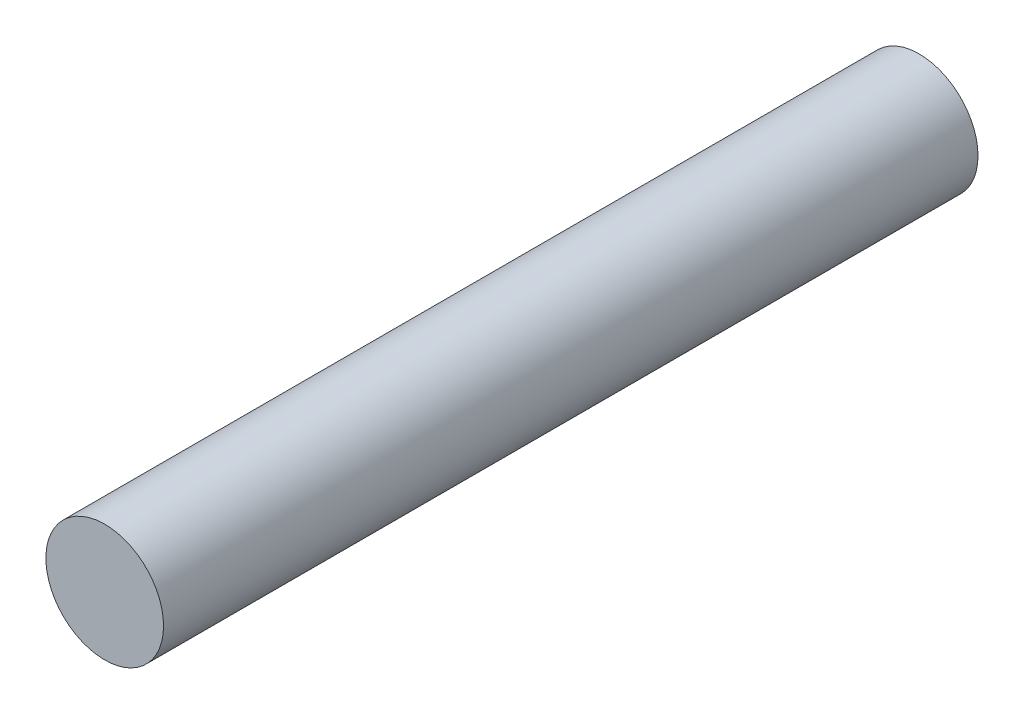
ISO-10303-21;
HEADER;
FILE_DESCRIPTION(('STEP AP214'),'2;1');
FILE_NAME('part.step','',(''),(''),'','','');
FILE_SCHEMA(('AUTOMOTIVE_DESIGN { 1 0 10303 214 1 1 1 1 }'));
ENDSEC;
DATA;
#1=APPLICATION_CONTEXT('core data for automotive mechanical design processes');
#2=APPLICATION_PROTOCOL_DEFINITION('international standard','automotive_design',2000,#1);
#3=PRODUCT_CONTEXT('',#1,'mechanical');
#4=PRODUCT('Part','Part','',(#3));
#5=PRODUCT_RELATED_PRODUCT_CATEGORY('part','',(#4));
#6=PRODUCT_DEFINITION_FORMATION('','',#4);
#7=PRODUCT_DEFINITION_CONTEXT('part definition',#1,'design');
#8=PRODUCT_DEFINITION('design','',#6,#7);
#9=PRODUCT_DEFINITION_SHAPE('','',#8);
#10=(LENGTH_UNIT() NAMED_UNIT(*) SI_UNIT(.MILLI.,.METRE.));
#11=(NAMED_UNIT(*) PLANE_ANGLE_UNIT() SI_UNIT($,.RADIAN.));
#12=(NAMED_UNIT(*) SI_UNIT($,.STERADIAN.) SOLID_ANGLE_UNIT());
#13=UNCERTAINTY_MEASURE_WITH_UNIT(LENGTH_MEASURE(1.E-05),#10,'distance_accuracy_value','');
#14=(GEOMETRIC_REPRESENTATION_CONTEXT(3) GLOBAL_UNCERTAINTY_ASSIGNED_CONTEXT((#13)) GLOBAL_UNIT_ASSIGNED_CONTEXT((#10,
#11,#12)) REPRESENTATION_CONTEXT('',''));
#15=CARTESIAN_POINT('',(0.,0.,0.));
#16=DIRECTION('',(0.,0.,1.));
#17=DIRECTION('',(1.,0.,0.));
#18=AXIS2_PLACEMENT_3D('',#15,#16,#17);
#19=CARTESIAN_POINT('',(0.,0.,45.));
#20=DIRECTION('',(0.,0.,-1.));
#21=DIRECTION('',(-1.,0.,0.));
#22=AXIS2_PLACEMENT_3D('',#19,#20,#21);
#23=CYLINDRICAL_SURFACE('',#22,6.5);
#24=CARTESIAN_POINT('',(0.,0.,45.));
#25=DIRECTION('',(0.,0.,1.));
#26=DIRECTION('',(1.,0.,0.));
#27=AXIS2_PLACEMENT_3D('',#24,#25,#26);
#28=CIRCLE('',#27,6.5);
#29=CARTESIAN_POINT('',(6.5,0.,45.));
#30=VERTEX_POINT('',#29);
#31=EDGE_CURVE('E10',#30,#30,#28,.T.);
#32=ORIENTED_EDGE('',*,*,#31,.F.);
#33=EDGE_LOOP('',(#32));
#34=FACE_BOUND('',#33,.T.);
#35=CARTESIAN_POINT('',(0.,0.,-45.));
#36=DIRECTION('',(0.,0.,1.));
#37=DIRECTION('',(1.,0.,0.));
#38=AXIS2_PLACEMENT_3D('',#35,#36,#37);
#39=CIRCLE('',#38,6.5);
#40=CARTESIAN_POINT('',(6.5,0.,-45.));
#41=VERTEX_POINT('',#40);
#42=EDGE_CURVE('E33',#41,#41,#39,.T.);
#43=ORIENTED_EDGE('',*,*,#42,.T.);
#44=EDGE_LOOP('',(#43));
#45=FACE_BOUND('',#44,.T.);
#46=ADVANCED_FACE('F30',(#34,#45),#23,.T.);
#47=CARTESIAN_POINT('',(0.,0.,45.));
#48=DIRECTION('',(0.,0.,1.));
#49=DIRECTION('',(1.,0.,0.));
#50=AXIS2_PLACEMENT_3D('',#47,#48,#49);
#51=PLANE('',#50);
#52=ORIENTED_EDGE('',*,*,#31,.T.);
#53=EDGE_LOOP('',(#52));
#54=FACE_BOUND('',#53,.T.);
#55=ADVANCED_FACE('F45',(#54),#51,.T.);
#56=CARTESIAN_POINT('',(0.,0.,-45.));
#57=DIRECTION('',(0.,0.,1.));
#58=DIRECTION('',(1.,0.,0.));
#59=AXIS2_PLACEMENT_3D('',#56,#57,#58);
#60=PLANE('',#59);
#61=ORIENTED_EDGE('',*,*,#42,.F.);
#62=EDGE_LOOP('',(#61));
#63=FACE_BOUND('',#62,.T.);
#64=ADVANCED_FACE('F43',(#63),#60,.F.);
#65=CLOSED_SHELL('',(#46,#55,#64));
#66=MANIFOLD_SOLID_BREP('B2',#65);
#67=ADVANCED_BREP_SHAPE_REPRESENTATION('',(#18,#66),#14);
#68=SHAPE_DEFINITION_REPRESENTATION(#9,#67);
ENDSEC;
END-ISO-10303-21;
